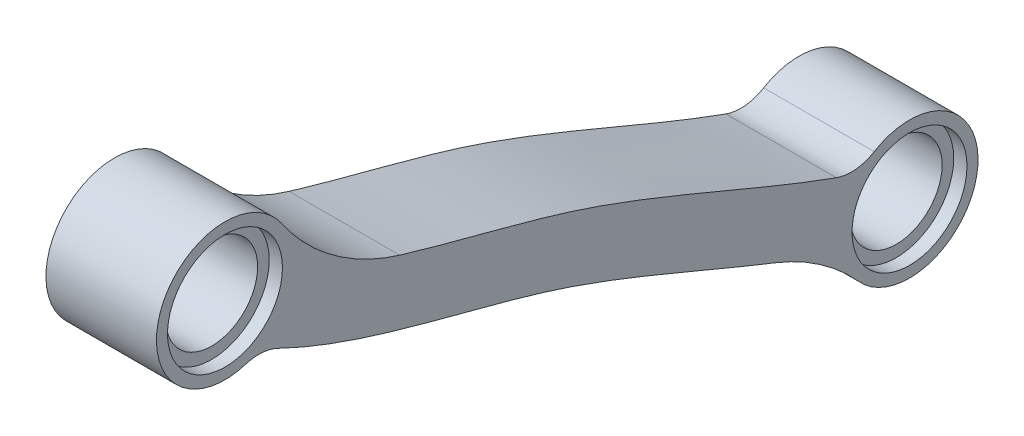
ISO-10303-21;
HEADER;
FILE_DESCRIPTION(('STEP AP214'),'2;1');
FILE_NAME('part.step','',(''),(''),'','','');
FILE_SCHEMA(('AUTOMOTIVE_DESIGN { 1 0 10303 214 1 1 1 1 }'));
ENDSEC;
DATA;
#1=APPLICATION_CONTEXT('core data for automotive mechanical design processes');
#2=APPLICATION_PROTOCOL_DEFINITION('international standard','automotive_design',2000,#1);
#3=PRODUCT_CONTEXT('',#1,'mechanical');
#4=PRODUCT('Part','Part','',(#3));
#5=PRODUCT_RELATED_PRODUCT_CATEGORY('part','',(#4));
#6=PRODUCT_DEFINITION_FORMATION('','',#4);
#7=PRODUCT_DEFINITION_CONTEXT('part definition',#1,'design');
#8=PRODUCT_DEFINITION('design','',#6,#7);
#9=PRODUCT_DEFINITION_SHAPE('','',#8);
#10=(LENGTH_UNIT() NAMED_UNIT(*) SI_UNIT(.MILLI.,.METRE.));
#11=(NAMED_UNIT(*) PLANE_ANGLE_UNIT() SI_UNIT($,.RADIAN.));
#12=(NAMED_UNIT(*) SI_UNIT($,.STERADIAN.) SOLID_ANGLE_UNIT());
#13=UNCERTAINTY_MEASURE_WITH_UNIT(LENGTH_MEASURE(1.E-05),#10,'distance_accuracy_value','');
#14=(GEOMETRIC_REPRESENTATION_CONTEXT(3) GLOBAL_UNCERTAINTY_ASSIGNED_CONTEXT((#13)) GLOBAL_UNIT_ASSIGNED_CONTEXT((#10,
#11,#12)) REPRESENTATION_CONTEXT('',''));
#15=CARTESIAN_POINT('',(0.,0.,0.));
#16=DIRECTION('',(0.,0.,1.));
#17=DIRECTION('',(1.,0.,0.));
#18=AXIS2_PLACEMENT_3D('',#15,#16,#17);
#19=CARTESIAN_POINT('',(2.5,-5.87,-16.415));
#20=DIRECTION('',(-1.,0.,0.));
#21=DIRECTION('',(0.,0.,1.));
#22=AXIS2_PLACEMENT_3D('',#19,#20,#21);
#23=CYLINDRICAL_SURFACE('',#22,2.075);
#24=CARTESIAN_POINT('',(1.9,-5.87,-16.415));
#25=DIRECTION('',(1.,0.,0.));
#26=DIRECTION('',(0.,0.,-1.));
#27=AXIS2_PLACEMENT_3D('',#24,#25,#26);
#28=CIRCLE('',#27,2.075);
#29=CARTESIAN_POINT('',(1.9,-5.87,-18.49));
#30=VERTEX_POINT('',#29);
#31=EDGE_CURVE('E166',#30,#30,#28,.T.);
#32=ORIENTED_EDGE('',*,*,#31,.T.);
#33=EDGE_LOOP('',(#32));
#34=FACE_BOUND('',#33,.T.);
#35=CARTESIAN_POINT('',(-1.9,-5.87,-16.415));
#36=DIRECTION('',(-1.,0.,0.));
#37=DIRECTION('',(0.,0.,1.));
#38=AXIS2_PLACEMENT_3D('',#35,#36,#37);
#39=CIRCLE('',#38,2.075);
#40=CARTESIAN_POINT('',(-1.9,-5.87,-14.34));
#41=VERTEX_POINT('',#40);
#42=EDGE_CURVE('E41',#41,#41,#39,.T.);
#43=ORIENTED_EDGE('',*,*,#42,.T.);
#44=EDGE_LOOP('',(#43));
#45=FACE_BOUND('',#44,.T.);
#46=ADVANCED_FACE('F37',(#34,#45),#23,.F.);
#47=CARTESIAN_POINT('',(2.5,5.62916512459887,14.555));
#48=DIRECTION('',(-1.,0.,0.));
#49=DIRECTION('',(0.,0.,1.));
#50=AXIS2_PLACEMENT_3D('',#47,#48,#49);
#51=CYLINDRICAL_SURFACE('',#50,2.075);
#52=CARTESIAN_POINT('',(1.9,5.62916512459887,14.555));
#53=DIRECTION('',(1.,0.,0.));
#54=DIRECTION('',(0.,0.,-1.));
#55=AXIS2_PLACEMENT_3D('',#52,#53,#54);
#56=CIRCLE('',#55,2.075);
#57=CARTESIAN_POINT('',(1.9,5.62916512459887,12.48));
#58=VERTEX_POINT('',#57);
#59=EDGE_CURVE('E163',#58,#58,#56,.T.);
#60=ORIENTED_EDGE('',*,*,#59,.T.);
#61=EDGE_LOOP('',(#60));
#62=FACE_BOUND('',#61,.T.);
#63=CARTESIAN_POINT('',(-1.9,5.62916512459887,14.555));
#64=DIRECTION('',(-1.,0.,0.));
#65=DIRECTION('',(0.,0.,1.));
#66=AXIS2_PLACEMENT_3D('',#63,#64,#65);
#67=CIRCLE('',#66,2.075);
#68=CARTESIAN_POINT('',(-1.9,5.62916512459887,16.63));
#69=VERTEX_POINT('',#68);
#70=EDGE_CURVE('E170',#69,#69,#67,.T.);
#71=ORIENTED_EDGE('',*,*,#70,.T.);
#72=EDGE_LOOP('',(#71));
#73=FACE_BOUND('',#72,.T.);
#74=ADVANCED_FACE('F214',(#62,#73),#51,.F.);
#75=CARTESIAN_POINT('',(2.5,6.75355176978644,13.7213107515191));
#76=CARTESIAN_POINT('',(2.5,5.21663552070412,11.6483241385644));
#77=CARTESIAN_POINT('',(2.5,3.78375069936955,8.07809039075831));
#78=CARTESIAN_POINT('',(2.5,2.39661944147079,2.77012570669555));
#79=CARTESIAN_POINT('',(2.5,1.28872767415253,-1.34779989848399));
#80=CARTESIAN_POINT('',(2.5,-0.215867298023037,-5.33895791516202));
#81=CARTESIAN_POINT('',(2.5,-1.84107121128289,-9.16032046052592));
#82=CARTESIAN_POINT('',(2.5,-3.37366564105275,-12.9398919170553));
#83=CARTESIAN_POINT('',(2.5,-4.18692261661027,-15.4648040327146));
#84=CARTESIAN_POINT('',(2.5,-4.51220142113037,-16.7568631738127));
#85=B_SPLINE_CURVE_WITH_KNOTS('',3,(#75,#76,#77,#78,#79,#80,#81,#82,#83,#84),.UNSPECIFIED.,.F.,
.F.,(4,1,1,1,1,1,1,4),(0.,0.25,0.375,0.5,0.625,0.75,0.875,1.),.UNSPECIFIED.);
#86=DIRECTION('',(-1.,0.,0.));
#87=VECTOR('',#86,1.);
#88=SURFACE_OF_LINEAR_EXTRUSION('',#85,#87);
#89=CARTESIAN_POINT('',(2.5,3.46427767015907,6.65183487445705));
#90=VERTEX_POINT('',#89);
#91=CARTESIAN_POINT('',(2.5,-3.38191795650755,-13.1080104040544));
#92=VERTEX_POINT('',#91);
#93=EDGE_CURVE('E128',#90,#92,#85,.T.);
#94=ORIENTED_EDGE('',*,*,#93,.T.);
#95=DIRECTION('',(-1.,0.,0.));
#96=VECTOR('',#95,1.);
#97=CARTESIAN_POINT('',(2.5,-3.38191795650771,-13.1080104040549));
#98=LINE('',#97,#96);
#99=CARTESIAN_POINT('',(-2.5,-3.38191795650755,-13.1080104040544));
#100=VERTEX_POINT('',#99);
#101=EDGE_CURVE('E150',#92,#100,#98,.T.);
#102=ORIENTED_EDGE('',*,*,#101,.T.);
#103=CARTESIAN_POINT('',(-2.5,6.75355176978644,13.7213107515191));
#104=CARTESIAN_POINT('',(-2.5,5.21663552070412,11.6483241385644));
#105=CARTESIAN_POINT('',(-2.5,3.78375069936955,8.07809039075831));
#106=CARTESIAN_POINT('',(-2.5,2.39661944147079,2.77012570669555));
#107=CARTESIAN_POINT('',(-2.5,1.28872767415253,-1.34779989848399));
#108=CARTESIAN_POINT('',(-2.5,-0.215867298023037,-5.33895791516202));
#109=CARTESIAN_POINT('',(-2.5,-1.84107121128289,-9.16032046052592));
#110=CARTESIAN_POINT('',(-2.5,-3.37366564105275,-12.9398919170553));
#111=CARTESIAN_POINT('',(-2.5,-4.18692261661027,-15.4648040327146));
#112=CARTESIAN_POINT('',(-2.5,-4.51220142113037,-16.7568631738127));
#113=B_SPLINE_CURVE_WITH_KNOTS('',3,(#103,#104,#105,#106,#107,#108,#109,#110,#111,#112),
.UNSPECIFIED.,.F.,.F.,(4,1,1,1,1,1,1,4),(0.,0.25,0.375,0.5,0.625,0.75,0.875,1.),.UNSPECIFIED.);
#114=CARTESIAN_POINT('',(-2.5,3.46427767015907,6.65183487445705));
#115=VERTEX_POINT('',#114);
#116=EDGE_CURVE('E169',#115,#100,#113,.T.);
#117=ORIENTED_EDGE('',*,*,#116,.F.);
#118=DIRECTION('',(-1.,0.,0.));
#119=VECTOR('',#118,1.);
#120=CARTESIAN_POINT('',(-2.5,3.46427767015907,6.65183487445705));
#121=LINE('',#120,#119);
#122=EDGE_CURVE('E114',#115,#90,#121,.F.);
#123=ORIENTED_EDGE('',*,*,#122,.T.);
#124=EDGE_LOOP('',(#94,#102,#117,#123));
#125=FACE_BOUND('',#124,.T.);
#126=ADVANCED_FACE('F209',(#125),#88,.T.);
#127=CARTESIAN_POINT('',(2.5,5.62916512459887,14.555));
#128=DIRECTION('',(-1.,0.,0.));
#129=DIRECTION('',(0.,0.,1.));
#130=AXIS2_PLACEMENT_3D('',#127,#128,#129);
#131=CYLINDRICAL_SURFACE('',#130,3.10000000000016);
#132=CARTESIAN_POINT('',(-2.5,5.62916512459887,14.555));
#133=DIRECTION('',(1.,0.,0.));
#134=DIRECTION('',(0.,0.,-1.));
#135=AXIS2_PLACEMENT_3D('',#132,#133,#134);
#136=CIRCLE('',#135,3.10000000000016);
#137=CARTESIAN_POINT('',(-2.5,7.38132324126687,11.9976689822795));
#138=VERTEX_POINT('',#137);
#139=CARTESIAN_POINT('',(-2.5,2.67178256216464,13.6255440411666));
#140=VERTEX_POINT('',#139);
#141=EDGE_CURVE('E134',#138,#140,#136,.T.);
#142=ORIENTED_EDGE('',*,*,#141,.T.);
#143=DIRECTION('',(-1.,0.,0.));
#144=VECTOR('',#143,1.);
#145=CARTESIAN_POINT('',(2.5,2.67178256216464,13.6255440411666));
#146=LINE('',#145,#144);
#147=CARTESIAN_POINT('',(2.5,2.67178256216464,13.6255440411666));
#148=VERTEX_POINT('',#147);
#149=EDGE_CURVE('E60',#140,#148,#146,.F.);
#150=ORIENTED_EDGE('',*,*,#149,.T.);
#151=CARTESIAN_POINT('',(2.5,5.62916512459887,14.555));
#152=DIRECTION('',(1.,0.,0.));
#153=DIRECTION('',(0.,0.,-1.));
#154=AXIS2_PLACEMENT_3D('',#151,#152,#153);
#155=CIRCLE('',#154,3.10000000000016);
#156=CARTESIAN_POINT('',(2.5,7.38132324126687,11.9976689822795));
#157=VERTEX_POINT('',#156);
#158=EDGE_CURVE('E132',#157,#148,#155,.T.);
#159=ORIENTED_EDGE('',*,*,#158,.F.);
#160=DIRECTION('',(-1.,0.,0.));
#161=VECTOR('',#160,1.);
#162=CARTESIAN_POINT('',(2.5,7.38132324126687,11.9976689822795));
#163=LINE('',#162,#161);
#164=EDGE_CURVE('E141',#157,#138,#163,.T.);
#165=ORIENTED_EDGE('',*,*,#164,.T.);
#166=EDGE_LOOP('',(#142,#150,#159,#165));
#167=FACE_BOUND('',#166,.T.);
#168=ADVANCED_FACE('F213',(#167),#131,.T.);
#169=CARTESIAN_POINT('',(2.5,4.50481662393664,15.3886633747564));
#170=CARTESIAN_POINT('',(2.5,4.05903054404012,14.7874374741777));
#171=CARTESIAN_POINT('',(2.5,3.23533210830311,13.5163153470166));
#172=CARTESIAN_POINT('',(2.5,1.92584043353058,10.9102030590395));
#173=CARTESIAN_POINT('',(2.5,0.743374894173409,7.52529104953849));
#174=CARTESIAN_POINT('',(2.5,-0.321587459880667,3.44058084919719));
#175=CARTESIAN_POINT('',(2.5,-1.38317307575393,-0.497631850871351));
#176=CARTESIAN_POINT('',(2.5,-2.80243686733353,-4.26209396726565));
#177=CARTESIAN_POINT('',(2.5,-4.41820077500662,-8.06688642570461));
#178=CARTESIAN_POINT('',(2.5,-5.99530820275826,-11.9443636508282));
#179=CARTESIAN_POINT('',(2.5,-6.87957017579544,-14.6885935101106));
#180=CARTESIAN_POINT('',(2.5,-7.22815951125186,-16.0730195639181));
#181=B_SPLINE_CURVE_WITH_KNOTS('',3,(#169,#170,#171,#172,#173,#174,#175,#176,#177,#178,#179,
#180),.UNSPECIFIED.,.F.,.F.,(4,1,1,1,1,1,1,1,1,4),(0.,0.0625,0.125,0.25,0.375,0.5,0.625,0.75,
0.875,1.),.UNSPECIFIED.);
#182=DIRECTION('',(-1.,0.,0.));
#183=VECTOR('',#182,1.);
#184=SURFACE_OF_LINEAR_EXTRUSION('',#181,#183);
#185=CARTESIAN_POINT('',(2.5,2.56432141679161,12.1552054552329));
#186=VERTEX_POINT('',#185);
#187=CARTESIAN_POINT('',(2.5,-5.33015632915728,-10.3394004830073));
#188=VERTEX_POINT('',#187);
#189=EDGE_CURVE('E247',#186,#188,#181,.T.);
#190=ORIENTED_EDGE('',*,*,#189,.F.);
#191=DIRECTION('',(-1.,0.,0.));
#192=VECTOR('',#191,1.);
#193=CARTESIAN_POINT('',(2.5,2.56432141679161,12.1552054552329));
#194=LINE('',#193,#192);
#195=CARTESIAN_POINT('',(-2.5,2.56432141679161,12.1552054552329));
#196=VERTEX_POINT('',#195);
#197=EDGE_CURVE('E155',#186,#196,#194,.T.);
#198=ORIENTED_EDGE('',*,*,#197,.T.);
#199=CARTESIAN_POINT('',(-2.5,4.50481662393664,15.3886633747564));
#200=CARTESIAN_POINT('',(-2.5,4.05903054404012,14.7874374741777));
#201=CARTESIAN_POINT('',(-2.5,3.23533210830311,13.5163153470166));
#202=CARTESIAN_POINT('',(-2.5,1.92584043353058,10.9102030590395));
#203=CARTESIAN_POINT('',(-2.5,0.743374894173409,7.52529104953849));
#204=CARTESIAN_POINT('',(-2.5,-0.321587459880667,3.44058084919719));
#205=CARTESIAN_POINT('',(-2.5,-1.38317307575393,-0.497631850871351));
#206=CARTESIAN_POINT('',(-2.5,-2.80243686733353,-4.26209396726565));
#207=CARTESIAN_POINT('',(-2.5,-4.41820077500662,-8.06688642570461));
#208=CARTESIAN_POINT('',(-2.5,-5.99530820275826,-11.9443636508282));
#209=CARTESIAN_POINT('',(-2.5,-6.87957017579544,-14.6885935101106));
#210=CARTESIAN_POINT('',(-2.5,-7.22815951125186,-16.0730195639181));
#211=B_SPLINE_CURVE_WITH_KNOTS('',3,(#199,#200,#201,#202,#203,#204,#205,#206,#207,#208,#209,
#210),.UNSPECIFIED.,.F.,.F.,(4,1,1,1,1,1,1,1,1,4),(0.,0.0625,0.125,0.25,0.375,0.5,0.625,0.75,
0.875,1.),.UNSPECIFIED.);
#212=CARTESIAN_POINT('',(-2.5,-5.33015632915728,-10.3394004830073));
#213=VERTEX_POINT('',#212);
#214=EDGE_CURVE('E129',#196,#213,#211,.T.);
#215=ORIENTED_EDGE('',*,*,#214,.T.);
#216=DIRECTION('',(-1.,0.,0.));
#217=VECTOR('',#216,1.);
#218=CARTESIAN_POINT('',(-2.5,-5.33015632915728,-10.3394004830073));
#219=LINE('',#218,#217);
#220=EDGE_CURVE('E111',#213,#188,#219,.F.);
#221=ORIENTED_EDGE('',*,*,#220,.T.);
#222=EDGE_LOOP('',(#190,#198,#215,#221));
#223=FACE_BOUND('',#222,.T.);
#224=ADVANCED_FACE('F244',(#223),#184,.F.);
#225=CARTESIAN_POINT('',(2.5,-5.87,-16.415));
#226=DIRECTION('',(-1.,0.,0.));
#227=DIRECTION('',(0.,0.,1.));
#228=AXIS2_PLACEMENT_3D('',#225,#226,#227);
#229=CYLINDRICAL_SURFACE('',#228,3.10000000000008);
#230=CARTESIAN_POINT('',(-2.5,-5.87,-16.415));
#231=DIRECTION('',(1.,0.,0.));
#232=DIRECTION('',(0.,0.,-1.));
#233=AXIS2_PLACEMENT_3D('',#230,#231,#232);
#234=CIRCLE('',#233,3.10000000000008);
#235=CARTESIAN_POINT('',(-2.5,-7.94461704656198,-14.1115321556152));
#236=VERTEX_POINT('',#235);
#237=CARTESIAN_POINT('',(-2.5,-3.21381732726576,-14.8166591073657));
#238=VERTEX_POINT('',#237);
#239=EDGE_CURVE('E120',#236,#238,#234,.T.);
#240=ORIENTED_EDGE('',*,*,#239,.T.);
#241=DIRECTION('',(-1.,0.,0.));
#242=VECTOR('',#241,1.);
#243=CARTESIAN_POINT('',(2.5,-3.21381732726576,-14.8166591073657));
#244=LINE('',#243,#242);
#245=CARTESIAN_POINT('',(2.5,-3.21381732726576,-14.8166591073657));
#246=VERTEX_POINT('',#245);
#247=EDGE_CURVE('E153',#238,#246,#244,.F.);
#248=ORIENTED_EDGE('',*,*,#247,.T.);
#249=CARTESIAN_POINT('',(2.5,-5.87,-16.415));
#250=DIRECTION('',(1.,0.,0.));
#251=DIRECTION('',(0.,0.,-1.));
#252=AXIS2_PLACEMENT_3D('',#249,#250,#251);
#253=CIRCLE('',#252,3.10000000000008);
#254=CARTESIAN_POINT('',(2.5,-7.94461704656198,-14.1115321556152));
#255=VERTEX_POINT('',#254);
#256=EDGE_CURVE('E123',#255,#246,#253,.T.);
#257=ORIENTED_EDGE('',*,*,#256,.F.);
#258=DIRECTION('',(-1.,0.,0.));
#259=VECTOR('',#258,1.);
#260=CARTESIAN_POINT('',(2.5,-7.94461704656198,-14.1115321556152));
#261=LINE('',#260,#259);
#262=EDGE_CURVE('E109',#255,#236,#261,.T.);
#263=ORIENTED_EDGE('',*,*,#262,.T.);
#264=EDGE_LOOP('',(#240,#248,#257,#263));
#265=FACE_BOUND('',#264,.T.);
#266=ADVANCED_FACE('F119',(#265),#229,.T.);
#267=CARTESIAN_POINT('',(2.5,0.,0.));
#268=DIRECTION('',(1.,0.,0.));
#269=DIRECTION('',(0.,0.,-1.));
#270=AXIS2_PLACEMENT_3D('',#267,#268,#269);
#271=PLANE('',#270);
#272=CARTESIAN_POINT('',(2.5,5.62916512459887,14.555));
#273=DIRECTION('',(1.,0.,0.));
#274=DIRECTION('',(0.,0.,-1.));
#275=AXIS2_PLACEMENT_3D('',#272,#273,#274);
#276=CIRCLE('',#275,2.6);
#277=CARTESIAN_POINT('',(2.5,5.62916512459887,11.955));
#278=VERTEX_POINT('',#277);
#279=EDGE_CURVE('E193',#278,#278,#276,.T.);
#280=ORIENTED_EDGE('',*,*,#279,.F.);
#281=EDGE_LOOP('',(#280));
#282=FACE_BOUND('',#281,.T.);
#283=CARTESIAN_POINT('',(2.5,-5.87,-16.415));
#284=DIRECTION('',(1.,0.,0.));
#285=DIRECTION('',(0.,0.,-1.));
#286=AXIS2_PLACEMENT_3D('',#283,#284,#285);
#287=CIRCLE('',#286,2.6);
#288=CARTESIAN_POINT('',(2.5,-5.87,-19.015));
#289=VERTEX_POINT('',#288);
#290=EDGE_CURVE('E176',#289,#289,#287,.T.);
#291=ORIENTED_EDGE('',*,*,#290,.F.);
#292=EDGE_LOOP('',(#291));
#293=FACE_BOUND('',#292,.T.);
#294=ORIENTED_EDGE('',*,*,#93,.F.);
#295=CARTESIAN_POINT('',(2.5,13.0334461982605,3.74821408640677));
#296=DIRECTION('',(1.,0.,0.));
#297=DIRECTION('',(0.,0.,-1.));
#298=AXIS2_PLACEMENT_3D('',#295,#296,#297);
#299=CIRCLE('',#298,10.);
#300=EDGE_CURVE('E148',#90,#157,#299,.F.);
#301=ORIENTED_EDGE('',*,*,#300,.T.);
#302=ORIENTED_EDGE('',*,*,#158,.T.);
#303=CARTESIAN_POINT('',(2.5,0.763793812207168,13.0258950354677));
#304=DIRECTION('',(1.,0.,0.));
#305=DIRECTION('',(0.,0.,-1.));
#306=AXIS2_PLACEMENT_3D('',#303,#304,#305);
#307=CIRCLE('',#306,2.);
#308=EDGE_CURVE('E11',#148,#186,#307,.F.);
#309=ORIENTED_EDGE('',*,*,#308,.T.);
#310=ORIENTED_EDGE('',*,*,#189,.T.);
#311=CARTESIAN_POINT('',(2.5,-14.6369300999875,-6.68099072211586));
#312=DIRECTION('',(1.,0.,0.));
#313=DIRECTION('',(0.,0.,-1.));
#314=AXIS2_PLACEMENT_3D('',#311,#312,#313);
#315=CIRCLE('',#314,10.);
#316=EDGE_CURVE('E113',#188,#255,#315,.F.);
#317=ORIENTED_EDGE('',*,*,#316,.T.);
#318=ORIENTED_EDGE('',*,*,#256,.T.);
#319=CARTESIAN_POINT('',(2.5,-1.5001510867921,-13.7854714346985));
#320=DIRECTION('',(1.,0.,0.));
#321=DIRECTION('',(0.,0.,-1.));
#322=AXIS2_PLACEMENT_3D('',#319,#320,#321);
#323=CIRCLE('',#322,2.);
#324=EDGE_CURVE('E160',#246,#92,#323,.F.);
#325=ORIENTED_EDGE('',*,*,#324,.T.);
#326=EDGE_LOOP('',(#294,#301,#302,#309,#310,#317,#318,#325));
#327=FACE_BOUND('',#326,.T.);
#328=ADVANCED_FACE('F243',(#282,#293,#327),#271,.T.);
#329=CARTESIAN_POINT('',(-2.5,0.,0.));
#330=DIRECTION('',(1.,0.,0.));
#331=DIRECTION('',(0.,0.,-1.));
#332=AXIS2_PLACEMENT_3D('',#329,#330,#331);
#333=PLANE('',#332);
#334=CARTESIAN_POINT('',(-2.5,5.62916512459887,14.555));
#335=DIRECTION('',(-1.,0.,0.));
#336=DIRECTION('',(0.,0.,1.));
#337=AXIS2_PLACEMENT_3D('',#334,#335,#336);
#338=CIRCLE('',#337,2.6);
#339=CARTESIAN_POINT('',(-2.5,5.62916512459887,17.155));
#340=VERTEX_POINT('',#339);
#341=EDGE_CURVE('E178',#340,#340,#338,.T.);
#342=ORIENTED_EDGE('',*,*,#341,.F.);
#343=EDGE_LOOP('',(#342));
#344=FACE_BOUND('',#343,.T.);
#345=CARTESIAN_POINT('',(-2.5,-5.87,-16.415));
#346=DIRECTION('',(-1.,0.,0.));
#347=DIRECTION('',(0.,0.,1.));
#348=AXIS2_PLACEMENT_3D('',#345,#346,#347);
#349=CIRCLE('',#348,2.6);
#350=CARTESIAN_POINT('',(-2.5,-5.87,-13.815));
#351=VERTEX_POINT('',#350);
#352=EDGE_CURVE('E188',#351,#351,#349,.T.);
#353=ORIENTED_EDGE('',*,*,#352,.F.);
#354=EDGE_LOOP('',(#353));
#355=FACE_BOUND('',#354,.T.);
#356=ORIENTED_EDGE('',*,*,#141,.F.);
#357=CARTESIAN_POINT('',(-2.5,13.0334461982605,3.74821408640677));
#358=DIRECTION('',(1.,0.,0.));
#359=DIRECTION('',(0.,0.,-1.));
#360=AXIS2_PLACEMENT_3D('',#357,#358,#359);
#361=CIRCLE('',#360,10.);
#362=EDGE_CURVE('E146',#138,#115,#361,.T.);
#363=ORIENTED_EDGE('',*,*,#362,.T.);
#364=ORIENTED_EDGE('',*,*,#116,.T.);
#365=CARTESIAN_POINT('',(-2.5,-1.5001510867921,-13.7854714346985));
#366=DIRECTION('',(1.,0.,0.));
#367=DIRECTION('',(0.,0.,-1.));
#368=AXIS2_PLACEMENT_3D('',#365,#366,#367);
#369=CIRCLE('',#368,2.);
#370=EDGE_CURVE('E127',#100,#238,#369,.T.);
#371=ORIENTED_EDGE('',*,*,#370,.T.);
#372=ORIENTED_EDGE('',*,*,#239,.F.);
#373=CARTESIAN_POINT('',(-2.5,-14.6369300999875,-6.68099072211586));
#374=DIRECTION('',(1.,0.,0.));
#375=DIRECTION('',(0.,0.,-1.));
#376=AXIS2_PLACEMENT_3D('',#373,#374,#375);
#377=CIRCLE('',#376,10.);
#378=EDGE_CURVE('E105',#236,#213,#377,.T.);
#379=ORIENTED_EDGE('',*,*,#378,.T.);
#380=ORIENTED_EDGE('',*,*,#214,.F.);
#381=CARTESIAN_POINT('',(-2.5,0.763793812207168,13.0258950354677));
#382=DIRECTION('',(1.,0.,0.));
#383=DIRECTION('',(0.,0.,-1.));
#384=AXIS2_PLACEMENT_3D('',#381,#382,#383);
#385=CIRCLE('',#384,2.);
#386=EDGE_CURVE('E46',#196,#140,#385,.T.);
#387=ORIENTED_EDGE('',*,*,#386,.T.);
#388=EDGE_LOOP('',(#356,#363,#364,#371,#372,#379,#380,#387));
#389=FACE_BOUND('',#388,.T.);
#390=ADVANCED_FACE('F125',(#344,#355,#389),#333,.F.);
#391=CARTESIAN_POINT('',(0.,-14.6369300999875,-6.68099072211586));
#392=DIRECTION('',(-1.,0.,0.));
#393=DIRECTION('',(0.,0.,1.));
#394=AXIS2_PLACEMENT_3D('',#391,#392,#393);
#395=CYLINDRICAL_SURFACE('',#394,10.);
#396=ORIENTED_EDGE('',*,*,#316,.F.);
#397=ORIENTED_EDGE('',*,*,#220,.F.);
#398=ORIENTED_EDGE('',*,*,#378,.F.);
#399=ORIENTED_EDGE('',*,*,#262,.F.);
#400=EDGE_LOOP('',(#396,#397,#398,#399));
#401=FACE_BOUND('',#400,.T.);
#402=ADVANCED_FACE('F108',(#401),#395,.F.);
#403=CARTESIAN_POINT('',(0.,13.0334461982605,3.74821408640677));
#404=DIRECTION('',(-1.,0.,0.));
#405=DIRECTION('',(0.,0.,1.));
#406=AXIS2_PLACEMENT_3D('',#403,#404,#405);
#407=CYLINDRICAL_SURFACE('',#406,10.);
#408=ORIENTED_EDGE('',*,*,#300,.F.);
#409=ORIENTED_EDGE('',*,*,#122,.F.);
#410=ORIENTED_EDGE('',*,*,#362,.F.);
#411=ORIENTED_EDGE('',*,*,#164,.F.);
#412=EDGE_LOOP('',(#408,#409,#410,#411));
#413=FACE_BOUND('',#412,.T.);
#414=ADVANCED_FACE('F219',(#413),#407,.F.);
#415=CARTESIAN_POINT('',(0.,-1.5001510867921,-13.7854714346985));
#416=DIRECTION('',(-1.,0.,0.));
#417=DIRECTION('',(0.,0.,1.));
#418=AXIS2_PLACEMENT_3D('',#415,#416,#417);
#419=CYLINDRICAL_SURFACE('',#418,2.);
#420=ORIENTED_EDGE('',*,*,#324,.F.);
#421=ORIENTED_EDGE('',*,*,#247,.F.);
#422=ORIENTED_EDGE('',*,*,#370,.F.);
#423=ORIENTED_EDGE('',*,*,#101,.F.);
#424=EDGE_LOOP('',(#420,#421,#422,#423));
#425=FACE_BOUND('',#424,.T.);
#426=ADVANCED_FACE('F221',(#425),#419,.F.);
#427=CARTESIAN_POINT('',(0.,0.763793812207168,13.0258950354677));
#428=DIRECTION('',(-1.,0.,0.));
#429=DIRECTION('',(0.,0.,1.));
#430=AXIS2_PLACEMENT_3D('',#427,#428,#429);
#431=CYLINDRICAL_SURFACE('',#430,2.);
#432=ORIENTED_EDGE('',*,*,#308,.F.);
#433=ORIENTED_EDGE('',*,*,#149,.F.);
#434=ORIENTED_EDGE('',*,*,#386,.F.);
#435=ORIENTED_EDGE('',*,*,#197,.F.);
#436=EDGE_LOOP('',(#432,#433,#434,#435));
#437=FACE_BOUND('',#436,.T.);
#438=ADVANCED_FACE('F39',(#437),#431,.F.);
#439=CARTESIAN_POINT('',(1.9,-5.87,-16.415));
#440=DIRECTION('',(1.,0.,0.));
#441=DIRECTION('',(0.,0.,-1.));
#442=AXIS2_PLACEMENT_3D('',#439,#440,#441);
#443=CYLINDRICAL_SURFACE('',#442,2.6);
#444=CARTESIAN_POINT('',(1.9,-5.87,-16.415));
#445=DIRECTION('',(1.,0.,0.));
#446=DIRECTION('',(0.,0.,-1.));
#447=AXIS2_PLACEMENT_3D('',#444,#445,#446);
#448=CIRCLE('',#447,2.6);
#449=CARTESIAN_POINT('',(1.9,-5.87,-19.015));
#450=VERTEX_POINT('',#449);
#451=EDGE_CURVE('E196',#450,#450,#448,.T.);
#452=ORIENTED_EDGE('',*,*,#451,.F.);
#453=EDGE_LOOP('',(#452));
#454=FACE_BOUND('',#453,.T.);
#455=ORIENTED_EDGE('',*,*,#290,.T.);
#456=EDGE_LOOP('',(#455));
#457=FACE_BOUND('',#456,.T.);
#458=ADVANCED_FACE('F228',(#454,#457),#443,.F.);
#459=CARTESIAN_POINT('',(1.9,-5.87,-16.415));
#460=DIRECTION('',(1.,0.,0.));
#461=DIRECTION('',(0.,0.,-1.));
#462=AXIS2_PLACEMENT_3D('',#459,#460,#461);
#463=PLANE('',#462);
#464=ORIENTED_EDGE('',*,*,#31,.F.);
#465=EDGE_LOOP('',(#464));
#466=FACE_BOUND('',#465,.T.);
#467=ORIENTED_EDGE('',*,*,#451,.T.);
#468=EDGE_LOOP('',(#467));
#469=FACE_BOUND('',#468,.T.);
#470=ADVANCED_FACE('F283',(#466,#469),#463,.T.);
#471=CARTESIAN_POINT('',(1.9,5.62916512459887,14.555));
#472=DIRECTION('',(1.,0.,0.));
#473=DIRECTION('',(0.,0.,-1.));
#474=AXIS2_PLACEMENT_3D('',#471,#472,#473);
#475=CYLINDRICAL_SURFACE('',#474,2.6);
#476=CARTESIAN_POINT('',(1.9,5.62916512459887,14.555));
#477=DIRECTION('',(1.,0.,0.));
#478=DIRECTION('',(0.,0.,-1.));
#479=AXIS2_PLACEMENT_3D('',#476,#477,#478);
#480=CIRCLE('',#479,2.6);
#481=CARTESIAN_POINT('',(1.9,5.62916512459887,11.955));
#482=VERTEX_POINT('',#481);
#483=EDGE_CURVE('E167',#482,#482,#480,.T.);
#484=ORIENTED_EDGE('',*,*,#483,.F.);
#485=EDGE_LOOP('',(#484));
#486=FACE_BOUND('',#485,.T.);
#487=ORIENTED_EDGE('',*,*,#279,.T.);
#488=EDGE_LOOP('',(#487));
#489=FACE_BOUND('',#488,.T.);
#490=ADVANCED_FACE('F287',(#486,#489),#475,.F.);
#491=CARTESIAN_POINT('',(1.9,5.62916512459887,14.555));
#492=DIRECTION('',(1.,0.,0.));
#493=DIRECTION('',(0.,0.,-1.));
#494=AXIS2_PLACEMENT_3D('',#491,#492,#493);
#495=PLANE('',#494);
#496=ORIENTED_EDGE('',*,*,#59,.F.);
#497=EDGE_LOOP('',(#496));
#498=FACE_BOUND('',#497,.T.);
#499=ORIENTED_EDGE('',*,*,#483,.T.);
#500=EDGE_LOOP('',(#499));
#501=FACE_BOUND('',#500,.T.);
#502=ADVANCED_FACE('F291',(#498,#501),#495,.T.);
#503=CARTESIAN_POINT('',(-1.9,-5.87,-16.415));
#504=DIRECTION('',(-1.,0.,0.));
#505=DIRECTION('',(0.,0.,1.));
#506=AXIS2_PLACEMENT_3D('',#503,#504,#505);
#507=CYLINDRICAL_SURFACE('',#506,2.6);
#508=CARTESIAN_POINT('',(-1.9,-5.87,-16.415));
#509=DIRECTION('',(-1.,0.,0.));
#510=DIRECTION('',(0.,0.,1.));
#511=AXIS2_PLACEMENT_3D('',#508,#509,#510);
#512=CIRCLE('',#511,2.6);
#513=CARTESIAN_POINT('',(-1.9,-5.87,-13.815));
#514=VERTEX_POINT('',#513);
#515=EDGE_CURVE('E183',#514,#514,#512,.T.);
#516=ORIENTED_EDGE('',*,*,#515,.F.);
#517=EDGE_LOOP('',(#516));
#518=FACE_BOUND('',#517,.T.);
#519=ORIENTED_EDGE('',*,*,#352,.T.);
#520=EDGE_LOOP('',(#519));
#521=FACE_BOUND('',#520,.T.);
#522=ADVANCED_FACE('F295',(#518,#521),#507,.F.);
#523=CARTESIAN_POINT('',(-1.9,-5.87,-16.415));
#524=DIRECTION('',(-1.,0.,0.));
#525=DIRECTION('',(0.,0.,1.));
#526=AXIS2_PLACEMENT_3D('',#523,#524,#525);
#527=PLANE('',#526);
#528=ORIENTED_EDGE('',*,*,#42,.F.);
#529=EDGE_LOOP('',(#528));
#530=FACE_BOUND('',#529,.T.);
#531=ORIENTED_EDGE('',*,*,#515,.T.);
#532=EDGE_LOOP('',(#531));
#533=FACE_BOUND('',#532,.T.);
#534=ADVANCED_FACE('F299',(#530,#533),#527,.T.);
#535=CARTESIAN_POINT('',(-1.9,5.62916512459887,14.555));
#536=DIRECTION('',(-1.,0.,0.));
#537=DIRECTION('',(0.,0.,1.));
#538=AXIS2_PLACEMENT_3D('',#535,#536,#537);
#539=CYLINDRICAL_SURFACE('',#538,2.6);
#540=CARTESIAN_POINT('',(-1.9,5.62916512459887,14.555));
#541=DIRECTION('',(-1.,0.,0.));
#542=DIRECTION('',(0.,0.,1.));
#543=AXIS2_PLACEMENT_3D('',#540,#541,#542);
#544=CIRCLE('',#543,2.6);
#545=CARTESIAN_POINT('',(-1.9,5.62916512459887,17.155));
#546=VERTEX_POINT('',#545);
#547=EDGE_CURVE('E172',#546,#546,#544,.T.);
#548=ORIENTED_EDGE('',*,*,#547,.F.);
#549=EDGE_LOOP('',(#548));
#550=FACE_BOUND('',#549,.T.);
#551=ORIENTED_EDGE('',*,*,#341,.T.);
#552=EDGE_LOOP('',(#551));
#553=FACE_BOUND('',#552,.T.);
#554=ADVANCED_FACE('F303',(#550,#553),#539,.F.);
#555=CARTESIAN_POINT('',(-1.9,5.62916512459887,14.555));
#556=DIRECTION('',(-1.,0.,0.));
#557=DIRECTION('',(0.,0.,1.));
#558=AXIS2_PLACEMENT_3D('',#555,#556,#557);
#559=PLANE('',#558);
#560=ORIENTED_EDGE('',*,*,#70,.F.);
#561=EDGE_LOOP('',(#560));
#562=FACE_BOUND('',#561,.T.);
#563=ORIENTED_EDGE('',*,*,#547,.T.);
#564=EDGE_LOOP('',(#563));
#565=FACE_BOUND('',#564,.T.);
#566=ADVANCED_FACE('F307',(#562,#565),#559,.T.);
#567=CLOSED_SHELL('',(#46,#74,#126,#168,#224,#266,#328,#390,#402,#414,#426,#438,#458,#470,#490,
#502,#522,#534,#554,#566));
#568=MANIFOLD_SOLID_BREP('B2',#567);
#569=ADVANCED_BREP_SHAPE_REPRESENTATION('',(#18,#568),#14);
#570=SHAPE_DEFINITION_REPRESENTATION(#9,#569);
ENDSEC;
END-ISO-10303-21;
